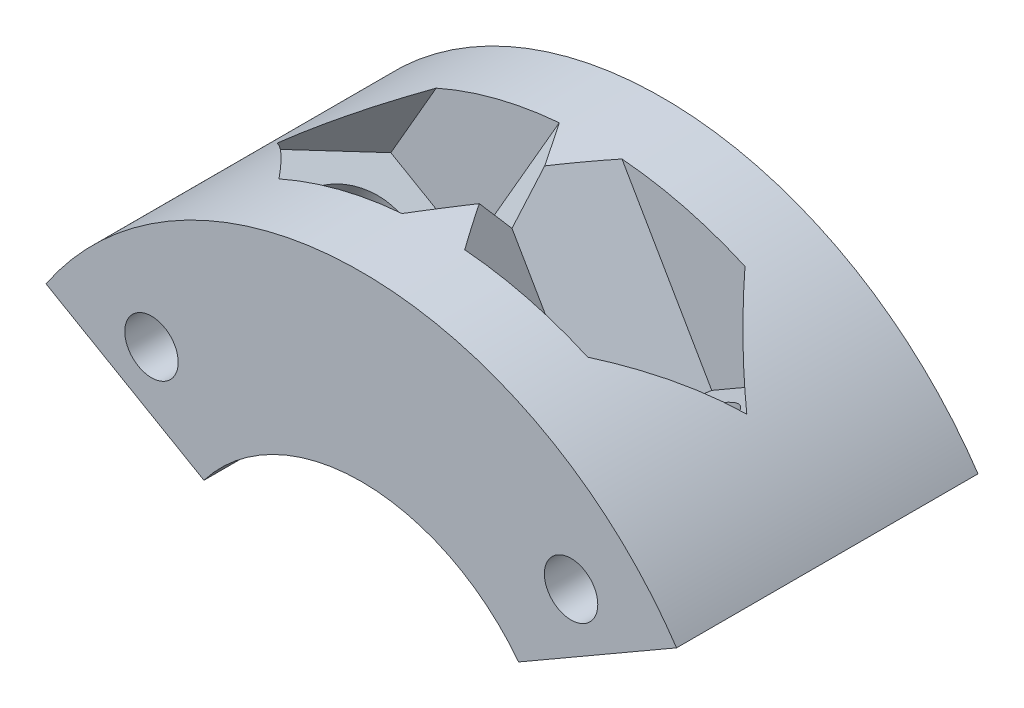
ISO-10303-21;
HEADER;
FILE_DESCRIPTION(('STEP AP214'),'2;1');
FILE_NAME('part.step','',(''),(''),'','','');
FILE_SCHEMA(('AUTOMOTIVE_DESIGN { 1 0 10303 214 1 1 1 1 }'));
ENDSEC;
DATA;
#1=APPLICATION_CONTEXT('core data for automotive mechanical design processes');
#2=APPLICATION_PROTOCOL_DEFINITION('international standard','automotive_design',2000,#1);
#3=PRODUCT_CONTEXT('',#1,'mechanical');
#4=PRODUCT('Part','Part','',(#3));
#5=PRODUCT_RELATED_PRODUCT_CATEGORY('part','',(#4));
#6=PRODUCT_DEFINITION_FORMATION('','',#4);
#7=PRODUCT_DEFINITION_CONTEXT('part definition',#1,'design');
#8=PRODUCT_DEFINITION('design','',#6,#7);
#9=PRODUCT_DEFINITION_SHAPE('','',#8);
#10=(LENGTH_UNIT() NAMED_UNIT(*) SI_UNIT(.MILLI.,.METRE.));
#11=(NAMED_UNIT(*) PLANE_ANGLE_UNIT() SI_UNIT($,.RADIAN.));
#12=(NAMED_UNIT(*) SI_UNIT($,.STERADIAN.) SOLID_ANGLE_UNIT());
#13=UNCERTAINTY_MEASURE_WITH_UNIT(LENGTH_MEASURE(1.E-05),#10,'distance_accuracy_value','');
#14=(GEOMETRIC_REPRESENTATION_CONTEXT(3) GLOBAL_UNCERTAINTY_ASSIGNED_CONTEXT((#13)) GLOBAL_UNIT_ASSIGNED_CONTEXT((#10,
#11,#12)) REPRESENTATION_CONTEXT('',''));
#15=CARTESIAN_POINT('',(0.,0.,0.));
#16=DIRECTION('',(0.,0.,1.));
#17=DIRECTION('',(1.,0.,0.));
#18=AXIS2_PLACEMENT_3D('',#15,#16,#17);
#19=CARTESIAN_POINT('',(0.,0.,12.7));
#20=DIRECTION('',(0.,0.,-1.));
#21=DIRECTION('',(-1.,0.,0.));
#22=AXIS2_PLACEMENT_3D('',#19,#20,#21);
#23=CYLINDRICAL_SURFACE('',#22,32.);
#24=CARTESIAN_POINT('',(0.,0.,-12.7));
#25=DIRECTION('',(0.,0.,1.));
#26=DIRECTION('',(1.,0.,0.));
#27=AXIS2_PLACEMENT_3D('',#24,#25,#26);
#28=CIRCLE('',#27,32.);
#29=CARTESIAN_POINT('',(-26.566778815336,17.8383369005357,-12.7));
#30=VERTEX_POINT('',#29);
#31=CARTESIAN_POINT('',(26.5667788153361,17.8383369005355,-12.7));
#32=VERTEX_POINT('',#31);
#33=EDGE_CURVE('E276',#30,#32,#28,.F.);
#34=ORIENTED_EDGE('',*,*,#33,.F.);
#35=DIRECTION('',(0.,0.,-1.));
#36=VECTOR('',#35,1.);
#37=CARTESIAN_POINT('',(-26.566778815336,17.8383369005357,12.7));
#38=LINE('',#37,#36);
#39=CARTESIAN_POINT('',(-26.566778815336,17.8383369005357,12.7));
#40=VERTEX_POINT('',#39);
#41=EDGE_CURVE('E292',#40,#30,#38,.T.);
#42=ORIENTED_EDGE('',*,*,#41,.F.);
#43=CARTESIAN_POINT('',(0.,0.,12.7));
#44=DIRECTION('',(0.,0.,1.));
#45=DIRECTION('',(1.,0.,0.));
#46=AXIS2_PLACEMENT_3D('',#43,#44,#45);
#47=CIRCLE('',#46,32.);
#48=CARTESIAN_POINT('',(26.5667788153361,17.8383369005355,12.7));
#49=VERTEX_POINT('',#48);
#50=EDGE_CURVE('E265',#40,#49,#47,.F.);
#51=ORIENTED_EDGE('',*,*,#50,.T.);
#52=DIRECTION('',(0.,0.,-1.));
#53=VECTOR('',#52,1.);
#54=CARTESIAN_POINT('',(26.5667788153361,17.8383369005355,12.7));
#55=LINE('',#54,#53);
#56=EDGE_CURVE('E275',#49,#32,#55,.T.);
#57=ORIENTED_EDGE('',*,*,#56,.T.);
#58=EDGE_LOOP('',(#34,#42,#51,#57));
#59=FACE_BOUND('',#58,.T.);
#60=CARTESIAN_POINT('',(0.,0.,-6.625));
#61=DIRECTION('',(0.,0.,1.));
#62=DIRECTION('',(1.,0.,0.));
#63=AXIS2_PLACEMENT_3D('',#60,#61,#62);
#64=CIRCLE('',#63,32.);
#65=CARTESIAN_POINT('',(-13.0085213886731,29.2365930176626,-6.625));
#66=VERTEX_POINT('',#65);
#67=CARTESIAN_POINT('',(-2.64285144000354,31.8906778897231,-6.625));
#68=VERTEX_POINT('',#67);
#69=EDGE_CURVE('E11',#66,#68,#64,.F.);
#70=ORIENTED_EDGE('',*,*,#69,.T.);
#71=CARTESIAN_POINT('',(0.,0.,24.9574143564121));
#72=DIRECTION('',(-0.750000000000001,0.433012701892218,0.5));
#73=DIRECTION('',(-0.43301270189222,0.249999999999999,-0.866025403784439));
#74=AXIS2_PLACEMENT_3D('',#71,#72,#73);
#75=ELLIPSE('',#74,64.,32.);
#76=CARTESIAN_POINT('',(0.,32.,-2.75539856468983));
#77=VERTEX_POINT('',#76);
#78=EDGE_CURVE('E205',#68,#77,#75,.F.);
#79=ORIENTED_EDGE('',*,*,#78,.T.);
#80=CARTESIAN_POINT('',(0.,0.,24.9574143564121));
#81=DIRECTION('',(-0.750000000000001,-0.433012701892218,-0.5));
#82=DIRECTION('',(0.43301270189222,0.249999999999999,-0.866025403784439));
#83=AXIS2_PLACEMENT_3D('',#80,#81,#82);
#84=ELLIPSE('',#83,64.,32.);
#85=CARTESIAN_POINT('',(2.64285144000353,31.8906778897231,-6.625));
#86=VERTEX_POINT('',#85);
#87=EDGE_CURVE('E306',#86,#77,#84,.F.);
#88=ORIENTED_EDGE('',*,*,#87,.F.);
#89=CARTESIAN_POINT('',(0.,0.,-6.625));
#90=DIRECTION('',(0.,0.,-1.));
#91=DIRECTION('',(-1.,0.,0.));
#92=AXIS2_PLACEMENT_3D('',#89,#90,#91);
#93=CIRCLE('',#92,32.);
#94=CARTESIAN_POINT('',(13.0085213886731,29.2365930176625,-6.625));
#95=VERTEX_POINT('',#94);
#96=EDGE_CURVE('E294',#95,#86,#93,.F.);
#97=ORIENTED_EDGE('',*,*,#96,.F.);
#98=CARTESIAN_POINT('',(0.,0.,-51.4574143564119));
#99=DIRECTION('',(0.75,0.433012701892217,-0.500000000000001));
#100=DIRECTION('',(-0.433012701892221,-0.25,-0.866025403784438));
#101=AXIS2_PLACEMENT_3D('',#98,#99,#100);
#102=ELLIPSE('',#101,63.9999999999999,32.);
#103=CARTESIAN_POINT('',(19.7835795670686,25.151739095209,0.));
#104=VERTEX_POINT('',#103);
#105=EDGE_CURVE('E298',#104,#95,#102,.F.);
#106=ORIENTED_EDGE('',*,*,#105,.F.);
#107=CARTESIAN_POINT('',(0.,0.,51.457414356412));
#108=DIRECTION('',(0.75,0.433012701892217,0.500000000000001));
#109=DIRECTION('',(0.433012701892221,0.25,-0.866025403784438));
#110=AXIS2_PLACEMENT_3D('',#107,#108,#109);
#111=ELLIPSE('',#110,63.9999999999999,32.);
#112=CARTESIAN_POINT('',(13.0085213886731,29.2365930176626,6.625));
#113=VERTEX_POINT('',#112);
#114=EDGE_CURVE('E300',#113,#104,#111,.F.);
#115=ORIENTED_EDGE('',*,*,#114,.F.);
#116=CARTESIAN_POINT('',(0.,0.,6.625));
#117=DIRECTION('',(0.,0.,1.));
#118=DIRECTION('',(1.,0.,0.));
#119=AXIS2_PLACEMENT_3D('',#116,#117,#118);
#120=CIRCLE('',#119,32.);
#121=CARTESIAN_POINT('',(2.64285144000354,31.8906778897231,6.625));
#122=VERTEX_POINT('',#121);
#123=EDGE_CURVE('E302',#122,#113,#120,.F.);
#124=ORIENTED_EDGE('',*,*,#123,.F.);
#125=CARTESIAN_POINT('',(0.,0.,-24.9574143564121));
#126=DIRECTION('',(-0.750000000000001,-0.433012701892218,0.5));
#127=DIRECTION('',(-0.43301270189222,-0.249999999999999,-0.866025403784439));
#128=AXIS2_PLACEMENT_3D('',#125,#126,#127);
#129=ELLIPSE('',#128,64.,32.);
#130=CARTESIAN_POINT('',(0.,32.,2.75539856468984));
#131=VERTEX_POINT('',#130);
#132=EDGE_CURVE('E304',#131,#122,#129,.F.);
#133=ORIENTED_EDGE('',*,*,#132,.F.);
#134=CARTESIAN_POINT('',(0.,0.,-24.9574143564121));
#135=DIRECTION('',(-0.750000000000001,0.433012701892218,-0.5));
#136=DIRECTION('',(0.43301270189222,-0.249999999999999,-0.866025403784439));
#137=AXIS2_PLACEMENT_3D('',#134,#135,#136);
#138=ELLIPSE('',#137,64.,32.);
#139=CARTESIAN_POINT('',(-2.64285144000354,31.8906778897231,6.625));
#140=VERTEX_POINT('',#139);
#141=EDGE_CURVE('E57',#131,#140,#138,.F.);
#142=ORIENTED_EDGE('',*,*,#141,.T.);
#143=CARTESIAN_POINT('',(0.,0.,6.625));
#144=DIRECTION('',(0.,0.,-1.));
#145=DIRECTION('',(-1.,0.,0.));
#146=AXIS2_PLACEMENT_3D('',#143,#144,#145);
#147=CIRCLE('',#146,32.);
#148=CARTESIAN_POINT('',(-13.0085213886731,29.2365930176625,6.625));
#149=VERTEX_POINT('',#148);
#150=EDGE_CURVE('E314',#140,#149,#147,.F.);
#151=ORIENTED_EDGE('',*,*,#150,.T.);
#152=CARTESIAN_POINT('',(0.,0.,51.457414356412));
#153=DIRECTION('',(0.75,-0.433012701892217,-0.500000000000001));
#154=DIRECTION('',(-0.433012701892221,0.25,-0.866025403784438));
#155=AXIS2_PLACEMENT_3D('',#152,#153,#154);
#156=ELLIPSE('',#155,63.9999999999999,32.);
#157=CARTESIAN_POINT('',(-19.7835795670686,25.151739095209,0.));
#158=VERTEX_POINT('',#157);
#159=EDGE_CURVE('E317',#149,#158,#156,.F.);
#160=ORIENTED_EDGE('',*,*,#159,.T.);
#161=CARTESIAN_POINT('',(0.,0.,-51.4574143564119));
#162=DIRECTION('',(0.75,-0.433012701892217,0.500000000000001));
#163=DIRECTION('',(0.433012701892221,-0.25,-0.866025403784438));
#164=AXIS2_PLACEMENT_3D('',#161,#162,#163);
#165=ELLIPSE('',#164,63.9999999999999,32.);
#166=EDGE_CURVE('E50',#158,#66,#165,.F.);
#167=ORIENTED_EDGE('',*,*,#166,.T.);
#168=EDGE_LOOP('',(#70,#79,#88,#97,#106,#115,#124,#133,#142,#151,#160,#167));
#169=FACE_BOUND('',#168,.T.);
#170=ADVANCED_FACE('F43',(#59,#169),#23,.T.);
#171=CARTESIAN_POINT('',(-8.01939398617888,42.7083376238774,0.));
#172=DIRECTION('',(-0.750000000000001,-0.433012701892218,-0.5));
#173=DIRECTION('',(-0.554700196225228,0.,0.832050294337844));
#174=AXIS2_PLACEMENT_3D('',#171,#172,#173);
#175=PLANE('',#174);
#176=DIRECTION('',(0.,0.755928946018455,-0.654653670707976));
#177=VECTOR('',#176,1.);
#178=CARTESIAN_POINT('',(0.,36.7554814110314,-6.87376627386764));
#179=LINE('',#178,#177);
#180=CARTESIAN_POINT('',(0.,28.8183397939032,0.));
#181=VERTEX_POINT('',#180);
#182=EDGE_CURVE('E312',#181,#77,#179,.T.);
#183=ORIENTED_EDGE('',*,*,#182,.F.);
#184=DIRECTION('',(0.499999999999998,-0.86602540378444,0.));
#185=VECTOR('',#184,1.);
#186=CARTESIAN_POINT('',(-8.01939398617888,42.7083376238774,0.));
#187=LINE('',#186,#185);
#188=CARTESIAN_POINT('',(6.89617542347554,16.8738135825357,0.));
#189=VERTEX_POINT('',#188);
#190=EDGE_CURVE('E242',#181,#189,#187,.T.);
#191=ORIENTED_EDGE('',*,*,#190,.T.);
#192=DIRECTION('',(0.43301270189222,0.249999999999999,-0.866025403784439));
#193=VECTOR('',#192,1.);
#194=CARTESIAN_POINT('',(6.89617542347554,16.8738135825357,0.));
#195=LINE('',#194,#193);
#196=CARTESIAN_POINT('',(10.2086754234755,18.7862863492263,-6.625));
#197=VERTEX_POINT('',#196);
#198=EDGE_CURVE('E224',#189,#197,#195,.T.);
#199=ORIENTED_EDGE('',*,*,#198,.T.);
#200=DIRECTION('',(0.499999999999998,-0.86602540378444,0.));
#201=VECTOR('',#200,1.);
#202=CARTESIAN_POINT('',(-4.70689398617888,44.620810390568,-6.625));
#203=LINE('',#202,#201);
#204=EDGE_CURVE('E241',#86,#197,#203,.T.);
#205=ORIENTED_EDGE('',*,*,#204,.F.);
#206=ORIENTED_EDGE('',*,*,#87,.T.);
#207=EDGE_LOOP('',(#183,#191,#199,#205,#206));
#208=FACE_BOUND('',#207,.T.);
#209=ADVANCED_FACE('F350',(#208),#175,.F.);
#210=CARTESIAN_POINT('',(-4.70689398617888,44.620810390568,6.625));
#211=DIRECTION('',(-0.750000000000001,-0.433012701892218,0.5));
#212=DIRECTION('',(0.554700196225228,0.,0.832050294337844));
#213=AXIS2_PLACEMENT_3D('',#210,#211,#212);
#214=PLANE('',#213);
#215=DIRECTION('',(0.,-0.755928946018455,-0.654653670707976));
#216=VECTOR('',#215,1.);
#217=CARTESIAN_POINT('',(0.,41.1268477348957,10.6594805595819));
#218=LINE('',#217,#216);
#219=EDGE_CURVE('E162',#131,#181,#218,.T.);
#220=ORIENTED_EDGE('',*,*,#219,.F.);
#221=ORIENTED_EDGE('',*,*,#132,.T.);
#222=DIRECTION('',(0.499999999999998,-0.86602540378444,0.));
#223=VECTOR('',#222,1.);
#224=CARTESIAN_POINT('',(-4.70689398617888,44.620810390568,6.625));
#225=LINE('',#224,#223);
#226=CARTESIAN_POINT('',(10.2086754234755,18.7862863492263,6.625));
#227=VERTEX_POINT('',#226);
#228=EDGE_CURVE('E245',#122,#227,#225,.T.);
#229=ORIENTED_EDGE('',*,*,#228,.T.);
#230=DIRECTION('',(-0.43301270189222,-0.249999999999999,-0.866025403784439));
#231=VECTOR('',#230,1.);
#232=CARTESIAN_POINT('',(10.2086754234755,18.7862863492263,6.625));
#233=LINE('',#232,#231);
#234=EDGE_CURVE('E238',#227,#189,#233,.T.);
#235=ORIENTED_EDGE('',*,*,#234,.T.);
#236=ORIENTED_EDGE('',*,*,#190,.F.);
#237=EDGE_LOOP('',(#220,#221,#229,#235,#236));
#238=FACE_BOUND('',#237,.T.);
#239=ADVANCED_FACE('F337',(#238),#214,.F.);
#240=CARTESIAN_POINT('',(1.08253175473055,1.87499999999999,12.7));
#241=DIRECTION('',(0.500000000000004,0.866025403784436,0.));
#242=DIRECTION('',(-0.866025403784436,0.500000000000004,0.));
#243=AXIS2_PLACEMENT_3D('',#240,#241,#242);
#244=PLANE('',#243);
#245=CARTESIAN_POINT('',(-18.0211754234755,12.9045304818571,0.));
#246=DIRECTION('',(0.500000000000004,0.866025403784436,0.));
#247=DIRECTION('',(-0.866025403784436,0.500000000000004,0.));
#248=AXIS2_PLACEMENT_3D('',#245,#246,#247);
#249=CIRCLE('',#248,4.35);
#250=CARTESIAN_POINT('',(-21.7883859299378,15.0795304818571,0.));
#251=VERTEX_POINT('',#250);
#252=EDGE_CURVE('E218',#251,#251,#249,.F.);
#253=ORIENTED_EDGE('',*,*,#252,.F.);
#254=EDGE_LOOP('',(#253));
#255=FACE_BOUND('',#254,.T.);
#256=DIRECTION('',(0.866025403784436,-0.500000000000004,0.));
#257=VECTOR('',#256,1.);
#258=CARTESIAN_POINT('',(1.08253175473055,1.87499999999999,-12.7));
#259=LINE('',#258,#257);
#260=CARTESIAN_POINT('',(-13.258035702661,10.1545304818571,-12.7));
#261=VERTEX_POINT('',#260);
#262=EDGE_CURVE('E279',#30,#261,#259,.T.);
#263=ORIENTED_EDGE('',*,*,#262,.T.);
#264=DIRECTION('',(0.,0.,-1.));
#265=VECTOR('',#264,1.);
#266=CARTESIAN_POINT('',(-13.258035702661,10.1545304818571,12.7));
#267=LINE('',#266,#265);
#268=CARTESIAN_POINT('',(-13.258035702661,10.1545304818571,12.7));
#269=VERTEX_POINT('',#268);
#270=EDGE_CURVE('E289',#269,#261,#267,.T.);
#271=ORIENTED_EDGE('',*,*,#270,.F.);
#272=DIRECTION('',(0.866025403784436,-0.500000000000004,0.));
#273=VECTOR('',#272,1.);
#274=CARTESIAN_POINT('',(1.08253175473055,1.87499999999999,12.7));
#275=LINE('',#274,#273);
#276=EDGE_CURVE('E268',#40,#269,#275,.T.);
#277=ORIENTED_EDGE('',*,*,#276,.F.);
#278=ORIENTED_EDGE('',*,*,#41,.T.);
#279=EDGE_LOOP('',(#263,#271,#277,#278));
#280=FACE_BOUND('',#279,.T.);
#281=ADVANCED_FACE('F388',(#255,#280),#244,.F.);
#282=CARTESIAN_POINT('',(0.,0.,12.7));
#283=DIRECTION('',(0.,0.,-1.));
#284=DIRECTION('',(-1.,0.,0.));
#285=AXIS2_PLACEMENT_3D('',#282,#283,#284);
#286=CYLINDRICAL_SURFACE('',#285,16.7);
#287=CARTESIAN_POINT('',(0.,0.,-12.7));
#288=DIRECTION('',(0.,0.,1.));
#289=DIRECTION('',(1.,0.,0.));
#290=AXIS2_PLACEMENT_3D('',#287,#288,#289);
#291=CIRCLE('',#290,16.7);
#292=CARTESIAN_POINT('',(13.2580357026611,10.154530481857,-12.7));
#293=VERTEX_POINT('',#292);
#294=EDGE_CURVE('E281',#261,#293,#291,.F.);
#295=ORIENTED_EDGE('',*,*,#294,.T.);
#296=DIRECTION('',(0.,0.,-1.));
#297=VECTOR('',#296,1.);
#298=CARTESIAN_POINT('',(13.2580357026611,10.154530481857,12.7));
#299=LINE('',#298,#297);
#300=CARTESIAN_POINT('',(13.2580357026611,10.154530481857,12.7));
#301=VERTEX_POINT('',#300);
#302=EDGE_CURVE('E286',#301,#293,#299,.T.);
#303=ORIENTED_EDGE('',*,*,#302,.F.);
#304=CARTESIAN_POINT('',(0.,0.,12.7));
#305=DIRECTION('',(0.,0.,1.));
#306=DIRECTION('',(1.,0.,0.));
#307=AXIS2_PLACEMENT_3D('',#304,#305,#306);
#308=CIRCLE('',#307,16.7);
#309=EDGE_CURVE('E271',#269,#301,#308,.F.);
#310=ORIENTED_EDGE('',*,*,#309,.F.);
#311=ORIENTED_EDGE('',*,*,#270,.T.);
#312=EDGE_LOOP('',(#295,#303,#310,#311));
#313=FACE_BOUND('',#312,.T.);
#314=ADVANCED_FACE('F391',(#313),#286,.F.);
#315=CARTESIAN_POINT('',(-1.08253175473054,1.875,12.7));
#316=DIRECTION('',(-0.499999999999998,0.86602540378444,0.));
#317=DIRECTION('',(-0.86602540378444,-0.499999999999998,0.));
#318=AXIS2_PLACEMENT_3D('',#315,#316,#317);
#319=PLANE('',#318);
#320=CARTESIAN_POINT('',(18.0211754234755,12.904530481857,0.));
#321=DIRECTION('',(-0.499999999999998,0.86602540378444,0.));
#322=DIRECTION('',(-0.86602540378444,-0.499999999999998,0.));
#323=AXIS2_PLACEMENT_3D('',#320,#321,#322);
#324=CIRCLE('',#323,4.35);
#325=CARTESIAN_POINT('',(14.2539649170132,10.729530481857,0.));
#326=VERTEX_POINT('',#325);
#327=EDGE_CURVE('E262',#326,#326,#324,.T.);
#328=ORIENTED_EDGE('',*,*,#327,.T.);
#329=EDGE_LOOP('',(#328));
#330=FACE_BOUND('',#329,.T.);
#331=DIRECTION('',(0.86602540378444,0.499999999999998,0.));
#332=VECTOR('',#331,1.);
#333=CARTESIAN_POINT('',(-1.08253175473054,1.875,-12.7));
#334=LINE('',#333,#332);
#335=EDGE_CURVE('E269',#293,#32,#334,.T.);
#336=ORIENTED_EDGE('',*,*,#335,.T.);
#337=ORIENTED_EDGE('',*,*,#56,.F.);
#338=DIRECTION('',(0.86602540378444,0.499999999999998,0.));
#339=VECTOR('',#338,1.);
#340=CARTESIAN_POINT('',(-1.08253175473054,1.875,12.7));
#341=LINE('',#340,#339);
#342=EDGE_CURVE('E273',#301,#49,#341,.T.);
#343=ORIENTED_EDGE('',*,*,#342,.F.);
#344=ORIENTED_EDGE('',*,*,#302,.T.);
#345=EDGE_LOOP('',(#336,#337,#343,#344));
#346=FACE_BOUND('',#345,.T.);
#347=ADVANCED_FACE('F398',(#330,#346),#319,.F.);
#348=CARTESIAN_POINT('',(0.,0.,12.7));
#349=DIRECTION('',(0.,0.,1.));
#350=DIRECTION('',(1.,0.,0.));
#351=AXIS2_PLACEMENT_3D('',#348,#349,#350);
#352=PLANE('',#351);
#353=CARTESIAN_POINT('',(-17.6776695296636,17.6776695296638,12.7));
#354=DIRECTION('',(0.,0.,1.));
#355=DIRECTION('',(1.,0.,0.));
#356=AXIS2_PLACEMENT_3D('',#353,#354,#355);
#357=CIRCLE('',#356,2.25);
#358=CARTESIAN_POINT('',(-15.4276695296636,17.6776695296638,12.7));
#359=VERTEX_POINT('',#358);
#360=EDGE_CURVE('E212',#359,#359,#357,.T.);
#361=ORIENTED_EDGE('',*,*,#360,.F.);
#362=EDGE_LOOP('',(#361));
#363=FACE_BOUND('',#362,.T.);
#364=CARTESIAN_POINT('',(17.6776695296636,17.6776695296638,12.7));
#365=DIRECTION('',(0.,0.,1.));
#366=DIRECTION('',(1.,0.,0.));
#367=AXIS2_PLACEMENT_3D('',#364,#365,#366);
#368=CIRCLE('',#367,2.25);
#369=CARTESIAN_POINT('',(19.9276695296636,17.6776695296638,12.7));
#370=VERTEX_POINT('',#369);
#371=EDGE_CURVE('E256',#370,#370,#368,.T.);
#372=ORIENTED_EDGE('',*,*,#371,.F.);
#373=EDGE_LOOP('',(#372));
#374=FACE_BOUND('',#373,.T.);
#375=ORIENTED_EDGE('',*,*,#50,.F.);
#376=ORIENTED_EDGE('',*,*,#276,.T.);
#377=ORIENTED_EDGE('',*,*,#309,.T.);
#378=ORIENTED_EDGE('',*,*,#342,.T.);
#379=EDGE_LOOP('',(#375,#376,#377,#378));
#380=FACE_BOUND('',#379,.T.);
#381=ADVANCED_FACE('F396',(#363,#374,#380),#352,.T.);
#382=CARTESIAN_POINT('',(0.,0.,-12.7));
#383=DIRECTION('',(0.,0.,1.));
#384=DIRECTION('',(1.,0.,0.));
#385=AXIS2_PLACEMENT_3D('',#382,#383,#384);
#386=PLANE('',#385);
#387=CARTESIAN_POINT('',(-17.6776695296636,17.6776695296638,-12.7));
#388=DIRECTION('',(0.,0.,1.));
#389=DIRECTION('',(1.,0.,0.));
#390=AXIS2_PLACEMENT_3D('',#387,#388,#389);
#391=CIRCLE('',#390,2.25);
#392=CARTESIAN_POINT('',(-15.4276695296636,17.6776695296638,-12.7));
#393=VERTEX_POINT('',#392);
#394=EDGE_CURVE('E208',#393,#393,#391,.T.);
#395=ORIENTED_EDGE('',*,*,#394,.T.);
#396=EDGE_LOOP('',(#395));
#397=FACE_BOUND('',#396,.T.);
#398=CARTESIAN_POINT('',(17.6776695296636,17.6776695296638,-12.7));
#399=DIRECTION('',(0.,0.,1.));
#400=DIRECTION('',(1.,0.,0.));
#401=AXIS2_PLACEMENT_3D('',#398,#399,#400);
#402=CIRCLE('',#401,2.25);
#403=CARTESIAN_POINT('',(19.9276695296636,17.6776695296638,-12.7));
#404=VERTEX_POINT('',#403);
#405=EDGE_CURVE('E244',#404,#404,#402,.T.);
#406=ORIENTED_EDGE('',*,*,#405,.T.);
#407=EDGE_LOOP('',(#406));
#408=FACE_BOUND('',#407,.T.);
#409=ORIENTED_EDGE('',*,*,#33,.T.);
#410=ORIENTED_EDGE('',*,*,#335,.F.);
#411=ORIENTED_EDGE('',*,*,#294,.F.);
#412=ORIENTED_EDGE('',*,*,#262,.F.);
#413=EDGE_LOOP('',(#409,#410,#411,#412));
#414=FACE_BOUND('',#413,.T.);
#415=ADVANCED_FACE('F384',(#397,#408,#414),#386,.F.);
#416=CARTESIAN_POINT('',(-1.39439398617888,46.5332831572587,0.));
#417=DIRECTION('',(0.499999999999998,-0.86602540378444,0.));
#418=DIRECTION('',(0.86602540378444,0.499999999999998,0.));
#419=AXIS2_PLACEMENT_3D('',#416,#417,#418);
#420=CYLINDRICAL_SURFACE('',#419,4.35);
#421=CARTESIAN_POINT('',(13.5211754234755,20.698759115917,0.));
#422=DIRECTION('',(0.499999999999998,-0.86602540378444,0.));
#423=DIRECTION('',(0.86602540378444,0.499999999999998,0.));
#424=AXIS2_PLACEMENT_3D('',#421,#422,#423);
#425=CIRCLE('',#424,4.35);
#426=CARTESIAN_POINT('',(17.2883859299379,22.873759115917,0.));
#427=VERTEX_POINT('',#426);
#428=EDGE_CURVE('E221',#427,#427,#425,.T.);
#429=ORIENTED_EDGE('',*,*,#428,.F.);
#430=EDGE_LOOP('',(#429));
#431=FACE_BOUND('',#430,.T.);
#432=ORIENTED_EDGE('',*,*,#327,.F.);
#433=EDGE_LOOP('',(#432));
#434=FACE_BOUND('',#433,.T.);
#435=ADVANCED_FACE('F600',(#431,#434),#420,.F.);
#436=CARTESIAN_POINT('',(17.6776695296636,17.6776695296638,4.7));
#437=DIRECTION('',(0.,0.,1.));
#438=DIRECTION('',(1.,0.,0.));
#439=AXIS2_PLACEMENT_3D('',#436,#437,#438);
#440=CYLINDRICAL_SURFACE('',#439,2.25);
#441=CARTESIAN_POINT('',(17.6776695296636,17.6776695296638,4.7));
#442=DIRECTION('',(0.,0.,1.));
#443=DIRECTION('',(1.,0.,0.));
#444=AXIS2_PLACEMENT_3D('',#441,#442,#443);
#445=CIRCLE('',#444,2.25);
#446=CARTESIAN_POINT('',(19.9276695296636,17.6776695296638,4.7));
#447=VERTEX_POINT('',#446);
#448=EDGE_CURVE('E259',#447,#447,#445,.T.);
#449=ORIENTED_EDGE('',*,*,#448,.F.);
#450=EDGE_LOOP('',(#449));
#451=FACE_BOUND('',#450,.T.);
#452=ORIENTED_EDGE('',*,*,#371,.T.);
#453=EDGE_LOOP('',(#452));
#454=FACE_BOUND('',#453,.T.);
#455=ADVANCED_FACE('F592',(#451,#454),#440,.F.);
#456=CARTESIAN_POINT('',(17.6776695296636,17.6776695296638,4.7));
#457=DIRECTION('',(0.,0.,1.));
#458=DIRECTION('',(1.,0.,0.));
#459=AXIS2_PLACEMENT_3D('',#456,#457,#458);
#460=PLANE('',#459);
#461=ORIENTED_EDGE('',*,*,#448,.T.);
#462=EDGE_LOOP('',(#461));
#463=FACE_BOUND('',#462,.T.);
#464=ADVANCED_FACE('F583',(#463),#460,.T.);
#465=CARTESIAN_POINT('',(17.6776695296636,17.6776695296638,-4.7));
#466=DIRECTION('',(0.,0.,-1.));
#467=DIRECTION('',(-1.,0.,0.));
#468=AXIS2_PLACEMENT_3D('',#465,#466,#467);
#469=CYLINDRICAL_SURFACE('',#468,2.25);
#470=CARTESIAN_POINT('',(17.6776695296636,17.6776695296638,-4.7));
#471=DIRECTION('',(0.,0.,1.));
#472=DIRECTION('',(1.,0.,0.));
#473=AXIS2_PLACEMENT_3D('',#470,#471,#472);
#474=CIRCLE('',#473,2.25);
#475=CARTESIAN_POINT('',(19.9276695296636,17.6776695296638,-4.7));
#476=VERTEX_POINT('',#475);
#477=EDGE_CURVE('E253',#476,#476,#474,.T.);
#478=ORIENTED_EDGE('',*,*,#477,.T.);
#479=EDGE_LOOP('',(#478));
#480=FACE_BOUND('',#479,.T.);
#481=ORIENTED_EDGE('',*,*,#405,.F.);
#482=EDGE_LOOP('',(#481));
#483=FACE_BOUND('',#482,.T.);
#484=ADVANCED_FACE('F574',(#480,#483),#469,.F.);
#485=CARTESIAN_POINT('',(17.6776695296636,17.6776695296638,-4.7));
#486=DIRECTION('',(0.,0.,1.));
#487=DIRECTION('',(1.,0.,0.));
#488=AXIS2_PLACEMENT_3D('',#485,#486,#487);
#489=PLANE('',#488);
#490=ORIENTED_EDGE('',*,*,#477,.F.);
#491=EDGE_LOOP('',(#490));
#492=FACE_BOUND('',#491,.T.);
#493=ADVANCED_FACE('F369',(#492),#489,.F.);
#494=CARTESIAN_POINT('',(1.91810601382113,48.4457559239493,6.625));
#495=DIRECTION('',(0.,0.,1.));
#496=DIRECTION('',(1.,0.,0.));
#497=AXIS2_PLACEMENT_3D('',#494,#495,#496);
#498=PLANE('',#497);
#499=ORIENTED_EDGE('',*,*,#123,.T.);
#500=DIRECTION('',(0.499999999999998,-0.86602540378444,0.));
#501=VECTOR('',#500,1.);
#502=CARTESIAN_POINT('',(1.91810601382113,48.4457559239493,6.625));
#503=LINE('',#502,#501);
#504=CARTESIAN_POINT('',(16.8336754234755,22.6112318826076,6.625));
#505=VERTEX_POINT('',#504);
#506=EDGE_CURVE('E247',#113,#505,#503,.T.);
#507=ORIENTED_EDGE('',*,*,#506,.T.);
#508=DIRECTION('',(-0.86602540378444,-0.499999999999998,0.));
#509=VECTOR('',#508,1.);
#510=CARTESIAN_POINT('',(16.8336754234755,22.6112318826076,6.625));
#511=LINE('',#510,#509);
#512=EDGE_CURVE('E235',#505,#227,#511,.T.);
#513=ORIENTED_EDGE('',*,*,#512,.T.);
#514=ORIENTED_EDGE('',*,*,#228,.F.);
#515=EDGE_LOOP('',(#499,#507,#513,#514));
#516=FACE_BOUND('',#515,.T.);
#517=ADVANCED_FACE('F340',(#516),#498,.F.);
#518=CARTESIAN_POINT('',(5.23060601382114,50.3582286906399,0.));
#519=DIRECTION('',(0.75,0.433012701892217,0.500000000000001));
#520=DIRECTION('',(0.55470019622523,0.,-0.832050294337843));
#521=AXIS2_PLACEMENT_3D('',#518,#519,#520);
#522=PLANE('',#521);
#523=ORIENTED_EDGE('',*,*,#114,.T.);
#524=DIRECTION('',(0.499999999999998,-0.86602540378444,0.));
#525=VECTOR('',#524,1.);
#526=CARTESIAN_POINT('',(5.23060601382114,50.3582286906399,0.));
#527=LINE('',#526,#525);
#528=CARTESIAN_POINT('',(20.1461754234756,24.5237046492982,0.));
#529=VERTEX_POINT('',#528);
#530=EDGE_CURVE('E249',#104,#529,#527,.T.);
#531=ORIENTED_EDGE('',*,*,#530,.T.);
#532=DIRECTION('',(-0.433012701892221,-0.25,0.866025403784438));
#533=VECTOR('',#532,1.);
#534=CARTESIAN_POINT('',(20.1461754234756,24.5237046492982,0.));
#535=LINE('',#534,#533);
#536=EDGE_CURVE('E232',#529,#505,#535,.T.);
#537=ORIENTED_EDGE('',*,*,#536,.T.);
#538=ORIENTED_EDGE('',*,*,#506,.F.);
#539=EDGE_LOOP('',(#523,#531,#537,#538));
#540=FACE_BOUND('',#539,.T.);
#541=ADVANCED_FACE('F361',(#540),#522,.F.);
#542=CARTESIAN_POINT('',(1.91810601382112,48.4457559239493,-6.625));
#543=DIRECTION('',(0.75,0.433012701892217,-0.500000000000001));
#544=DIRECTION('',(-0.55470019622523,0.,-0.832050294337843));
#545=AXIS2_PLACEMENT_3D('',#542,#543,#544);
#546=PLANE('',#545);
#547=ORIENTED_EDGE('',*,*,#105,.T.);
#548=DIRECTION('',(0.499999999999998,-0.86602540378444,0.));
#549=VECTOR('',#548,1.);
#550=CARTESIAN_POINT('',(1.91810601382112,48.4457559239493,-6.625));
#551=LINE('',#550,#549);
#552=CARTESIAN_POINT('',(16.8336754234755,22.6112318826076,-6.625));
#553=VERTEX_POINT('',#552);
#554=EDGE_CURVE('E65',#95,#553,#551,.T.);
#555=ORIENTED_EDGE('',*,*,#554,.T.);
#556=DIRECTION('',(0.433012701892221,0.25,0.866025403784438));
#557=VECTOR('',#556,1.);
#558=CARTESIAN_POINT('',(16.8336754234755,22.6112318826076,-6.625));
#559=LINE('',#558,#557);
#560=EDGE_CURVE('E229',#553,#529,#559,.T.);
#561=ORIENTED_EDGE('',*,*,#560,.T.);
#562=ORIENTED_EDGE('',*,*,#530,.F.);
#563=EDGE_LOOP('',(#547,#555,#561,#562));
#564=FACE_BOUND('',#563,.T.);
#565=ADVANCED_FACE('F359',(#564),#546,.F.);
#566=CARTESIAN_POINT('',(-4.70689398617888,44.620810390568,-6.625));
#567=DIRECTION('',(0.,0.,-1.));
#568=DIRECTION('',(-1.,0.,0.));
#569=AXIS2_PLACEMENT_3D('',#566,#567,#568);
#570=PLANE('',#569);
#571=ORIENTED_EDGE('',*,*,#96,.T.);
#572=ORIENTED_EDGE('',*,*,#204,.T.);
#573=DIRECTION('',(0.86602540378444,0.499999999999998,0.));
#574=VECTOR('',#573,1.);
#575=CARTESIAN_POINT('',(10.2086754234755,18.7862863492263,-6.625));
#576=LINE('',#575,#574);
#577=EDGE_CURVE('E227',#197,#553,#576,.T.);
#578=ORIENTED_EDGE('',*,*,#577,.T.);
#579=ORIENTED_EDGE('',*,*,#554,.F.);
#580=EDGE_LOOP('',(#571,#572,#578,#579));
#581=FACE_BOUND('',#580,.T.);
#582=ADVANCED_FACE('F355',(#581),#570,.F.);
#583=CARTESIAN_POINT('',(-5.58253175473053,9.66922863405996,0.));
#584=DIRECTION('',(0.499999999999998,-0.86602540378444,0.));
#585=DIRECTION('',(0.86602540378444,0.499999999999998,0.));
#586=AXIS2_PLACEMENT_3D('',#583,#584,#585);
#587=PLANE('',#586);
#588=ORIENTED_EDGE('',*,*,#428,.T.);
#589=EDGE_LOOP('',(#588));
#590=FACE_BOUND('',#589,.T.);
#591=ORIENTED_EDGE('',*,*,#198,.F.);
#592=ORIENTED_EDGE('',*,*,#234,.F.);
#593=ORIENTED_EDGE('',*,*,#512,.F.);
#594=ORIENTED_EDGE('',*,*,#536,.F.);
#595=ORIENTED_EDGE('',*,*,#560,.F.);
#596=ORIENTED_EDGE('',*,*,#577,.F.);
#597=EDGE_LOOP('',(#591,#592,#593,#594,#595,#596));
#598=FACE_BOUND('',#597,.T.);
#599=ADVANCED_FACE('F347',(#590,#598),#587,.F.);
#600=CARTESIAN_POINT('',(1.39439398617891,46.5332831572587,0.));
#601=DIRECTION('',(-0.499999999999998,-0.86602540378444,0.));
#602=DIRECTION('',(0.86602540378444,-0.499999999999998,0.));
#603=AXIS2_PLACEMENT_3D('',#600,#601,#602);
#604=CYLINDRICAL_SURFACE('',#603,4.35);
#605=CARTESIAN_POINT('',(-13.5211754234755,20.698759115917,0.));
#606=DIRECTION('',(0.499999999999998,0.86602540378444,0.));
#607=DIRECTION('',(-0.86602540378444,0.499999999999998,0.));
#608=AXIS2_PLACEMENT_3D('',#605,#606,#607);
#609=CIRCLE('',#608,4.35);
#610=CARTESIAN_POINT('',(-17.2883859299379,22.873759115917,0.));
#611=VERTEX_POINT('',#610);
#612=EDGE_CURVE('E184',#611,#611,#609,.T.);
#613=ORIENTED_EDGE('',*,*,#612,.T.);
#614=EDGE_LOOP('',(#613));
#615=FACE_BOUND('',#614,.T.);
#616=ORIENTED_EDGE('',*,*,#252,.T.);
#617=EDGE_LOOP('',(#616));
#618=FACE_BOUND('',#617,.T.);
#619=ADVANCED_FACE('F419',(#615,#618),#604,.F.);
#620=CARTESIAN_POINT('',(-17.6776695296636,17.6776695296638,4.7));
#621=DIRECTION('',(0.,0.,1.));
#622=DIRECTION('',(1.,0.,0.));
#623=AXIS2_PLACEMENT_3D('',#620,#621,#622);
#624=CYLINDRICAL_SURFACE('',#623,2.25);
#625=CARTESIAN_POINT('',(-17.6776695296636,17.6776695296638,4.7));
#626=DIRECTION('',(0.,0.,1.));
#627=DIRECTION('',(1.,0.,0.));
#628=AXIS2_PLACEMENT_3D('',#625,#626,#627);
#629=CIRCLE('',#628,2.25);
#630=CARTESIAN_POINT('',(-15.4276695296636,17.6776695296638,4.7));
#631=VERTEX_POINT('',#630);
#632=EDGE_CURVE('E215',#631,#631,#629,.T.);
#633=ORIENTED_EDGE('',*,*,#632,.F.);
#634=EDGE_LOOP('',(#633));
#635=FACE_BOUND('',#634,.T.);
#636=ORIENTED_EDGE('',*,*,#360,.T.);
#637=EDGE_LOOP('',(#636));
#638=FACE_BOUND('',#637,.T.);
#639=ADVANCED_FACE('F421',(#635,#638),#624,.F.);
#640=CARTESIAN_POINT('',(-17.6776695296636,17.6776695296638,4.7));
#641=DIRECTION('',(0.,0.,1.));
#642=DIRECTION('',(1.,0.,0.));
#643=AXIS2_PLACEMENT_3D('',#640,#641,#642);
#644=PLANE('',#643);
#645=ORIENTED_EDGE('',*,*,#632,.T.);
#646=EDGE_LOOP('',(#645));
#647=FACE_BOUND('',#646,.T.);
#648=ADVANCED_FACE('F428',(#647),#644,.T.);
#649=CARTESIAN_POINT('',(-17.6776695296636,17.6776695296638,-4.7));
#650=DIRECTION('',(0.,0.,-1.));
#651=DIRECTION('',(-1.,0.,0.));
#652=AXIS2_PLACEMENT_3D('',#649,#650,#651);
#653=CYLINDRICAL_SURFACE('',#652,2.25);
#654=CARTESIAN_POINT('',(-17.6776695296636,17.6776695296638,-4.7));
#655=DIRECTION('',(0.,0.,1.));
#656=DIRECTION('',(1.,0.,0.));
#657=AXIS2_PLACEMENT_3D('',#654,#655,#656);
#658=CIRCLE('',#657,2.25);
#659=CARTESIAN_POINT('',(-15.4276695296636,17.6776695296638,-4.7));
#660=VERTEX_POINT('',#659);
#661=EDGE_CURVE('E209',#660,#660,#658,.T.);
#662=ORIENTED_EDGE('',*,*,#661,.T.);
#663=EDGE_LOOP('',(#662));
#664=FACE_BOUND('',#663,.T.);
#665=ORIENTED_EDGE('',*,*,#394,.F.);
#666=EDGE_LOOP('',(#665));
#667=FACE_BOUND('',#666,.T.);
#668=ADVANCED_FACE('F436',(#664,#667),#653,.F.);
#669=CARTESIAN_POINT('',(-17.6776695296636,17.6776695296638,-4.7));
#670=DIRECTION('',(0.,0.,1.));
#671=DIRECTION('',(1.,0.,0.));
#672=AXIS2_PLACEMENT_3D('',#669,#670,#671);
#673=PLANE('',#672);
#674=ORIENTED_EDGE('',*,*,#661,.F.);
#675=EDGE_LOOP('',(#674));
#676=FACE_BOUND('',#675,.T.);
#677=ADVANCED_FACE('F440',(#676),#673,.F.);
#678=CARTESIAN_POINT('',(5.58253175473053,9.66922863405996,0.));
#679=DIRECTION('',(-0.499999999999998,-0.86602540378444,0.));
#680=DIRECTION('',(-0.86602540378444,0.499999999999998,0.));
#681=AXIS2_PLACEMENT_3D('',#678,#679,#680);
#682=PLANE('',#681);
#683=DIRECTION('',(-0.43301270189222,0.249999999999999,-0.866025403784439));
#684=VECTOR('',#683,1.);
#685=CARTESIAN_POINT('',(-6.89617542347554,16.8738135825357,0.));
#686=LINE('',#685,#684);
#687=CARTESIAN_POINT('',(-6.89617542347554,16.8738135825357,0.));
#688=VERTEX_POINT('',#687);
#689=CARTESIAN_POINT('',(-10.2086754234755,18.7862863492263,-6.625));
#690=VERTEX_POINT('',#689);
#691=EDGE_CURVE('E175',#688,#690,#686,.T.);
#692=ORIENTED_EDGE('',*,*,#691,.T.);
#693=DIRECTION('',(-0.86602540378444,0.499999999999998,0.));
#694=VECTOR('',#693,1.);
#695=CARTESIAN_POINT('',(-10.2086754234755,18.7862863492263,-6.625));
#696=LINE('',#695,#694);
#697=CARTESIAN_POINT('',(-16.8336754234755,22.6112318826076,-6.625));
#698=VERTEX_POINT('',#697);
#699=EDGE_CURVE('E167',#690,#698,#696,.T.);
#700=ORIENTED_EDGE('',*,*,#699,.T.);
#701=DIRECTION('',(-0.433012701892221,0.25,0.866025403784438));
#702=VECTOR('',#701,1.);
#703=CARTESIAN_POINT('',(-16.8336754234755,22.6112318826076,-6.625));
#704=LINE('',#703,#702);
#705=CARTESIAN_POINT('',(-20.1461754234756,24.5237046492982,0.));
#706=VERTEX_POINT('',#705);
#707=EDGE_CURVE('E192',#698,#706,#704,.T.);
#708=ORIENTED_EDGE('',*,*,#707,.T.);
#709=DIRECTION('',(0.433012701892221,-0.25,0.866025403784438));
#710=VECTOR('',#709,1.);
#711=CARTESIAN_POINT('',(-20.1461754234756,24.5237046492982,0.));
#712=LINE('',#711,#710);
#713=CARTESIAN_POINT('',(-16.8336754234755,22.6112318826076,6.625));
#714=VERTEX_POINT('',#713);
#715=EDGE_CURVE('E190',#706,#714,#712,.T.);
#716=ORIENTED_EDGE('',*,*,#715,.T.);
#717=DIRECTION('',(0.86602540378444,-0.499999999999998,0.));
#718=VECTOR('',#717,1.);
#719=CARTESIAN_POINT('',(-16.8336754234755,22.6112318826076,6.625));
#720=LINE('',#719,#718);
#721=CARTESIAN_POINT('',(-10.2086754234755,18.7862863492263,6.625));
#722=VERTEX_POINT('',#721);
#723=EDGE_CURVE('E178',#714,#722,#720,.T.);
#724=ORIENTED_EDGE('',*,*,#723,.T.);
#725=DIRECTION('',(0.43301270189222,-0.249999999999999,-0.866025403784439));
#726=VECTOR('',#725,1.);
#727=CARTESIAN_POINT('',(-10.2086754234755,18.7862863492263,6.625));
#728=LINE('',#727,#726);
#729=EDGE_CURVE('E161',#722,#688,#728,.T.);
#730=ORIENTED_EDGE('',*,*,#729,.T.);
#731=EDGE_LOOP('',(#692,#700,#708,#716,#724,#730));
#732=FACE_BOUND('',#731,.T.);
#733=ORIENTED_EDGE('',*,*,#612,.F.);
#734=EDGE_LOOP('',(#733));
#735=FACE_BOUND('',#734,.T.);
#736=ADVANCED_FACE('F172',(#732,#735),#682,.F.);
#737=CARTESIAN_POINT('',(8.01939398617891,42.7083376238775,0.));
#738=DIRECTION('',(-0.750000000000001,0.433012701892218,0.5));
#739=DIRECTION('',(0.554700196225228,0.,0.832050294337844));
#740=AXIS2_PLACEMENT_3D('',#737,#738,#739);
#741=PLANE('',#740);
#742=DIRECTION('',(-0.499999999999998,-0.86602540378444,0.));
#743=VECTOR('',#742,1.);
#744=CARTESIAN_POINT('',(4.70689398617891,44.6208103905681,-6.625));
#745=LINE('',#744,#743);
#746=EDGE_CURVE('E182',#68,#690,#745,.T.);
#747=ORIENTED_EDGE('',*,*,#746,.T.);
#748=ORIENTED_EDGE('',*,*,#691,.F.);
#749=DIRECTION('',(-0.499999999999998,-0.86602540378444,0.));
#750=VECTOR('',#749,1.);
#751=CARTESIAN_POINT('',(8.01939398617891,42.7083376238775,0.));
#752=LINE('',#751,#750);
#753=EDGE_CURVE('E158',#181,#688,#752,.T.);
#754=ORIENTED_EDGE('',*,*,#753,.F.);
#755=ORIENTED_EDGE('',*,*,#182,.T.);
#756=ORIENTED_EDGE('',*,*,#78,.F.);
#757=EDGE_LOOP('',(#747,#748,#754,#755,#756));
#758=FACE_BOUND('',#757,.T.);
#759=ADVANCED_FACE('F180',(#758),#741,.T.);
#760=CARTESIAN_POINT('',(4.70689398617891,44.6208103905681,-6.625));
#761=DIRECTION('',(0.,0.,1.));
#762=DIRECTION('',(1.,0.,0.));
#763=AXIS2_PLACEMENT_3D('',#760,#761,#762);
#764=PLANE('',#763);
#765=DIRECTION('',(-0.499999999999998,-0.86602540378444,0.));
#766=VECTOR('',#765,1.);
#767=CARTESIAN_POINT('',(-1.9181060138211,48.4457559239494,-6.625));
#768=LINE('',#767,#766);
#769=EDGE_CURVE('E197',#66,#698,#768,.T.);
#770=ORIENTED_EDGE('',*,*,#769,.T.);
#771=ORIENTED_EDGE('',*,*,#699,.F.);
#772=ORIENTED_EDGE('',*,*,#746,.F.);
#773=ORIENTED_EDGE('',*,*,#69,.F.);
#774=EDGE_LOOP('',(#770,#771,#772,#773));
#775=FACE_BOUND('',#774,.T.);
#776=ADVANCED_FACE('F447',(#775),#764,.T.);
#777=CARTESIAN_POINT('',(-1.9181060138211,48.4457559239494,-6.625));
#778=DIRECTION('',(0.75,-0.433012701892217,0.500000000000001));
#779=DIRECTION('',(0.55470019622523,0.,-0.832050294337843));
#780=AXIS2_PLACEMENT_3D('',#777,#778,#779);
#781=PLANE('',#780);
#782=DIRECTION('',(-0.499999999999998,-0.86602540378444,0.));
#783=VECTOR('',#782,1.);
#784=CARTESIAN_POINT('',(-5.23060601382111,50.35822869064,0.));
#785=LINE('',#784,#783);
#786=EDGE_CURVE('E199',#158,#706,#785,.T.);
#787=ORIENTED_EDGE('',*,*,#786,.T.);
#788=ORIENTED_EDGE('',*,*,#707,.F.);
#789=ORIENTED_EDGE('',*,*,#769,.F.);
#790=ORIENTED_EDGE('',*,*,#166,.F.);
#791=EDGE_LOOP('',(#787,#788,#789,#790));
#792=FACE_BOUND('',#791,.T.);
#793=ADVANCED_FACE('F324',(#792),#781,.T.);
#794=CARTESIAN_POINT('',(-5.23060601382111,50.35822869064,0.));
#795=DIRECTION('',(0.75,-0.433012701892217,-0.500000000000001));
#796=DIRECTION('',(-0.55470019622523,0.,-0.832050294337843));
#797=AXIS2_PLACEMENT_3D('',#794,#795,#796);
#798=PLANE('',#797);
#799=DIRECTION('',(-0.499999999999998,-0.86602540378444,0.));
#800=VECTOR('',#799,1.);
#801=CARTESIAN_POINT('',(-1.9181060138211,48.4457559239494,6.625));
#802=LINE('',#801,#800);
#803=EDGE_CURVE('E201',#149,#714,#802,.T.);
#804=ORIENTED_EDGE('',*,*,#803,.T.);
#805=ORIENTED_EDGE('',*,*,#715,.F.);
#806=ORIENTED_EDGE('',*,*,#786,.F.);
#807=ORIENTED_EDGE('',*,*,#159,.F.);
#808=EDGE_LOOP('',(#804,#805,#806,#807));
#809=FACE_BOUND('',#808,.T.);
#810=ADVANCED_FACE('F328',(#809),#798,.T.);
#811=CARTESIAN_POINT('',(-1.9181060138211,48.4457559239494,6.625));
#812=DIRECTION('',(0.,0.,-1.));
#813=DIRECTION('',(-1.,0.,0.));
#814=AXIS2_PLACEMENT_3D('',#811,#812,#813);
#815=PLANE('',#814);
#816=DIRECTION('',(-0.499999999999998,-0.86602540378444,0.));
#817=VECTOR('',#816,1.);
#818=CARTESIAN_POINT('',(4.70689398617891,44.6208103905681,6.625));
#819=LINE('',#818,#817);
#820=EDGE_CURVE('E166',#140,#722,#819,.T.);
#821=ORIENTED_EDGE('',*,*,#820,.T.);
#822=ORIENTED_EDGE('',*,*,#723,.F.);
#823=ORIENTED_EDGE('',*,*,#803,.F.);
#824=ORIENTED_EDGE('',*,*,#150,.F.);
#825=EDGE_LOOP('',(#821,#822,#823,#824));
#826=FACE_BOUND('',#825,.T.);
#827=ADVANCED_FACE('F331',(#826),#815,.T.);
#828=CARTESIAN_POINT('',(4.70689398617891,44.6208103905681,6.625));
#829=DIRECTION('',(-0.750000000000001,0.433012701892218,-0.5));
#830=DIRECTION('',(-0.554700196225228,0.,0.832050294337844));
#831=AXIS2_PLACEMENT_3D('',#828,#829,#830);
#832=PLANE('',#831);
#833=ORIENTED_EDGE('',*,*,#219,.T.);
#834=ORIENTED_EDGE('',*,*,#753,.T.);
#835=ORIENTED_EDGE('',*,*,#729,.F.);
#836=ORIENTED_EDGE('',*,*,#820,.F.);
#837=ORIENTED_EDGE('',*,*,#141,.F.);
#838=EDGE_LOOP('',(#833,#834,#835,#836,#837));
#839=FACE_BOUND('',#838,.T.);
#840=ADVANCED_FACE('F160',(#839),#832,.T.);
#841=CLOSED_SHELL('',(#170,#209,#239,#281,#314,#347,#381,#415,#435,#455,#464,#484,#493,#517,
#541,#565,#582,#599,#619,#639,#648,#668,#677,#736,#759,#776,#793,#810,#827,#840));
#842=MANIFOLD_SOLID_BREP('B2',#841);
#843=ADVANCED_BREP_SHAPE_REPRESENTATION('',(#18,#842),#14);
#844=SHAPE_DEFINITION_REPRESENTATION(#9,#843);
ENDSEC;
END-ISO-10303-21;
